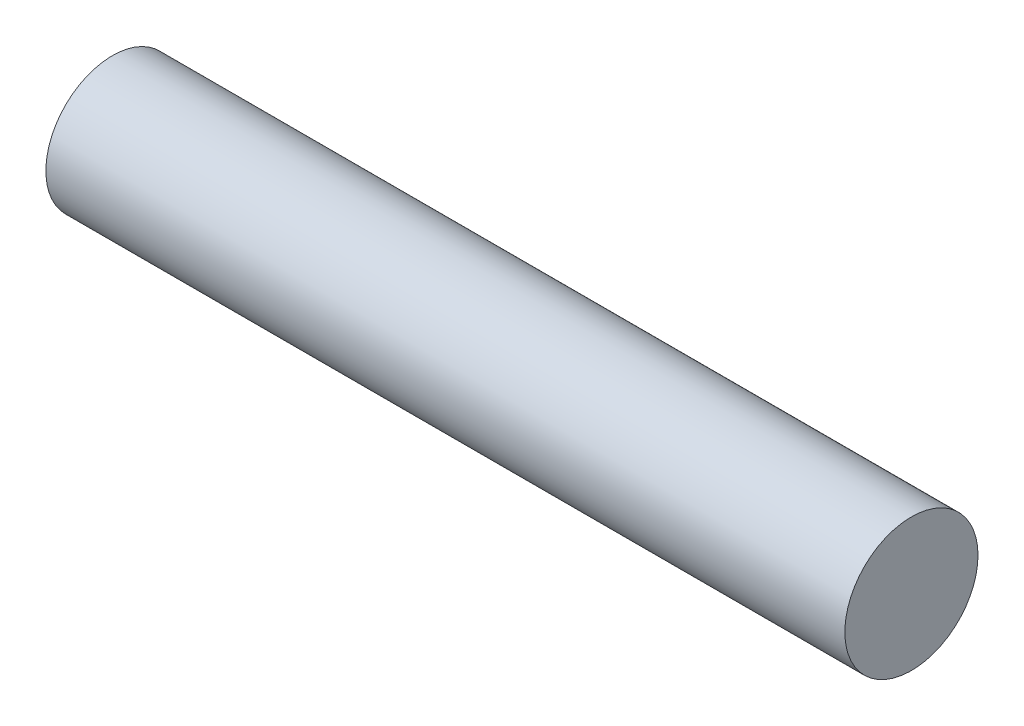
ISO-10303-21;
HEADER;
FILE_DESCRIPTION(('STEP AP214'),'2;1');
FILE_NAME('part.step','',(''),(''),'','','');
FILE_SCHEMA(('AUTOMOTIVE_DESIGN { 1 0 10303 214 1 1 1 1 }'));
ENDSEC;
DATA;
#1=APPLICATION_CONTEXT('core data for automotive mechanical design processes');
#2=APPLICATION_PROTOCOL_DEFINITION('international standard','automotive_design',2000,#1);
#3=PRODUCT_CONTEXT('',#1,'mechanical');
#4=PRODUCT('Part','Part','',(#3));
#5=PRODUCT_RELATED_PRODUCT_CATEGORY('part','',(#4));
#6=PRODUCT_DEFINITION_FORMATION('','',#4);
#7=PRODUCT_DEFINITION_CONTEXT('part definition',#1,'design');
#8=PRODUCT_DEFINITION('design','',#6,#7);
#9=PRODUCT_DEFINITION_SHAPE('','',#8);
#10=(LENGTH_UNIT() NAMED_UNIT(*) SI_UNIT(.MILLI.,.METRE.));
#11=(NAMED_UNIT(*) PLANE_ANGLE_UNIT() SI_UNIT($,.RADIAN.));
#12=(NAMED_UNIT(*) SI_UNIT($,.STERADIAN.) SOLID_ANGLE_UNIT());
#13=UNCERTAINTY_MEASURE_WITH_UNIT(LENGTH_MEASURE(1.E-05),#10,'distance_accuracy_value','');
#14=(GEOMETRIC_REPRESENTATION_CONTEXT(3) GLOBAL_UNCERTAINTY_ASSIGNED_CONTEXT((#13)) GLOBAL_UNIT_ASSIGNED_CONTEXT((#10,
#11,#12)) REPRESENTATION_CONTEXT('',''));
#15=CARTESIAN_POINT('',(0.,0.,0.));
#16=DIRECTION('',(0.,0.,1.));
#17=DIRECTION('',(1.,0.,0.));
#18=AXIS2_PLACEMENT_3D('',#15,#16,#17);
#19=CARTESIAN_POINT('',(76.2,0.,0.));
#20=DIRECTION('',(-1.,0.,0.));
#21=DIRECTION('',(0.,0.,1.));
#22=AXIS2_PLACEMENT_3D('',#19,#20,#21);
#23=CYLINDRICAL_SURFACE('',#22,6.35);
#24=CARTESIAN_POINT('',(76.2,0.,0.));
#25=DIRECTION('',(1.,0.,0.));
#26=DIRECTION('',(0.,0.,-1.));
#27=AXIS2_PLACEMENT_3D('',#24,#25,#26);
#28=CIRCLE('',#27,6.35);
#29=CARTESIAN_POINT('',(76.2,0.,-6.35));
#30=VERTEX_POINT('',#29);
#31=EDGE_CURVE('E10',#30,#30,#28,.T.);
#32=ORIENTED_EDGE('',*,*,#31,.F.);
#33=EDGE_LOOP('',(#32));
#34=FACE_BOUND('',#33,.T.);
#35=CARTESIAN_POINT('',(0.,0.,0.));
#36=DIRECTION('',(1.,0.,0.));
#37=DIRECTION('',(0.,0.,-1.));
#38=AXIS2_PLACEMENT_3D('',#35,#36,#37);
#39=CIRCLE('',#38,6.35);
#40=CARTESIAN_POINT('',(0.,0.,-6.35));
#41=VERTEX_POINT('',#40);
#42=EDGE_CURVE('E31',#41,#41,#39,.T.);
#43=ORIENTED_EDGE('',*,*,#42,.T.);
#44=EDGE_LOOP('',(#43));
#45=FACE_BOUND('',#44,.T.);
#46=ADVANCED_FACE('F28',(#34,#45),#23,.T.);
#47=CARTESIAN_POINT('',(76.2,0.,0.));
#48=DIRECTION('',(1.,0.,0.));
#49=DIRECTION('',(0.,0.,-1.));
#50=AXIS2_PLACEMENT_3D('',#47,#48,#49);
#51=PLANE('',#50);
#52=ORIENTED_EDGE('',*,*,#31,.T.);
#53=EDGE_LOOP('',(#52));
#54=FACE_BOUND('',#53,.T.);
#55=ADVANCED_FACE('F43',(#54),#51,.T.);
#56=CARTESIAN_POINT('',(0.,0.,0.));
#57=DIRECTION('',(1.,0.,0.));
#58=DIRECTION('',(0.,0.,-1.));
#59=AXIS2_PLACEMENT_3D('',#56,#57,#58);
#60=PLANE('',#59);
#61=ORIENTED_EDGE('',*,*,#42,.F.);
#62=EDGE_LOOP('',(#61));
#63=FACE_BOUND('',#62,.T.);
#64=ADVANCED_FACE('F41',(#63),#60,.F.);
#65=CLOSED_SHELL('',(#46,#55,#64));
#66=MANIFOLD_SOLID_BREP('B2',#65);
#67=ADVANCED_BREP_SHAPE_REPRESENTATION('',(#18,#66),#14);
#68=SHAPE_DEFINITION_REPRESENTATION(#9,#67);
ENDSEC;
END-ISO-10303-21;
